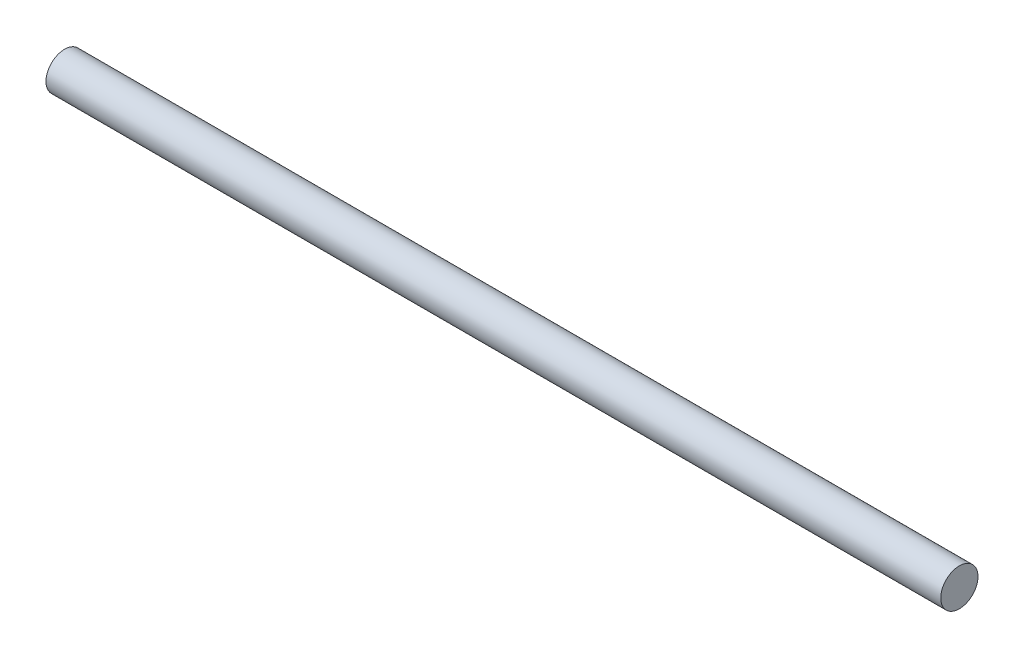
ISO-10303-21;
HEADER;
FILE_DESCRIPTION(('STEP AP214'),'2;1');
FILE_NAME('part.step','',(''),(''),'','','');
FILE_SCHEMA(('AUTOMOTIVE_DESIGN { 1 0 10303 214 1 1 1 1 }'));
ENDSEC;
DATA;
#1=APPLICATION_CONTEXT('core data for automotive mechanical design processes');
#2=APPLICATION_PROTOCOL_DEFINITION('international standard','automotive_design',2000,#1);
#3=PRODUCT_CONTEXT('',#1,'mechanical');
#4=PRODUCT('Part','Part','',(#3));
#5=PRODUCT_RELATED_PRODUCT_CATEGORY('part','',(#4));
#6=PRODUCT_DEFINITION_FORMATION('','',#4);
#7=PRODUCT_DEFINITION_CONTEXT('part definition',#1,'design');
#8=PRODUCT_DEFINITION('design','',#6,#7);
#9=PRODUCT_DEFINITION_SHAPE('','',#8);
#10=(LENGTH_UNIT() NAMED_UNIT(*) SI_UNIT(.MILLI.,.METRE.));
#11=(NAMED_UNIT(*) PLANE_ANGLE_UNIT() SI_UNIT($,.RADIAN.));
#12=(NAMED_UNIT(*) SI_UNIT($,.STERADIAN.) SOLID_ANGLE_UNIT());
#13=UNCERTAINTY_MEASURE_WITH_UNIT(LENGTH_MEASURE(1.E-05),#10,'distance_accuracy_value','');
#14=(GEOMETRIC_REPRESENTATION_CONTEXT(3) GLOBAL_UNCERTAINTY_ASSIGNED_CONTEXT((#13)) GLOBAL_UNIT_ASSIGNED_CONTEXT((#10,
#11,#12)) REPRESENTATION_CONTEXT('',''));
#15=CARTESIAN_POINT('',(0.,0.,0.));
#16=DIRECTION('',(0.,0.,1.));
#17=DIRECTION('',(1.,0.,0.));
#18=AXIS2_PLACEMENT_3D('',#15,#16,#17);
#19=CARTESIAN_POINT('',(228.6,0.,0.));
#20=DIRECTION('',(-1.,0.,0.));
#21=DIRECTION('',(0.,0.,1.));
#22=AXIS2_PLACEMENT_3D('',#19,#20,#21);
#23=CYLINDRICAL_SURFACE('',#22,4.7625);
#24=CARTESIAN_POINT('',(228.6,0.,0.));
#25=DIRECTION('',(1.,0.,0.));
#26=DIRECTION('',(0.,0.,-1.));
#27=AXIS2_PLACEMENT_3D('',#24,#25,#26);
#28=CIRCLE('',#27,4.7625);
#29=CARTESIAN_POINT('',(228.6,0.,-4.7625));
#30=VERTEX_POINT('',#29);
#31=EDGE_CURVE('E10',#30,#30,#28,.T.);
#32=ORIENTED_EDGE('',*,*,#31,.F.);
#33=EDGE_LOOP('',(#32));
#34=FACE_BOUND('',#33,.T.);
#35=CARTESIAN_POINT('',(0.,0.,0.));
#36=DIRECTION('',(1.,0.,0.));
#37=DIRECTION('',(0.,0.,-1.));
#38=AXIS2_PLACEMENT_3D('',#35,#36,#37);
#39=CIRCLE('',#38,4.7625);
#40=CARTESIAN_POINT('',(0.,0.,-4.7625));
#41=VERTEX_POINT('',#40);
#42=EDGE_CURVE('E34',#41,#41,#39,.T.);
#43=ORIENTED_EDGE('',*,*,#42,.T.);
#44=EDGE_LOOP('',(#43));
#45=FACE_BOUND('',#44,.T.);
#46=ADVANCED_FACE('F31',(#34,#45),#23,.T.);
#47=CARTESIAN_POINT('',(228.6,0.,0.));
#48=DIRECTION('',(1.,0.,0.));
#49=DIRECTION('',(0.,0.,-1.));
#50=AXIS2_PLACEMENT_3D('',#47,#48,#49);
#51=PLANE('',#50);
#52=ORIENTED_EDGE('',*,*,#31,.T.);
#53=EDGE_LOOP('',(#52));
#54=FACE_BOUND('',#53,.T.);
#55=ADVANCED_FACE('F46',(#54),#51,.T.);
#56=CARTESIAN_POINT('',(0.,0.,0.));
#57=DIRECTION('',(1.,0.,0.));
#58=DIRECTION('',(0.,0.,-1.));
#59=AXIS2_PLACEMENT_3D('',#56,#57,#58);
#60=PLANE('',#59);
#61=ORIENTED_EDGE('',*,*,#42,.F.);
#62=EDGE_LOOP('',(#61));
#63=FACE_BOUND('',#62,.T.);
#64=ADVANCED_FACE('F44',(#63),#60,.F.);
#65=CLOSED_SHELL('',(#46,#55,#64));
#66=MANIFOLD_SOLID_BREP('B2',#65);
#67=ADVANCED_BREP_SHAPE_REPRESENTATION('',(#18,#66),#14);
#68=SHAPE_DEFINITION_REPRESENTATION(#9,#67);
ENDSEC;
END-ISO-10303-21;
